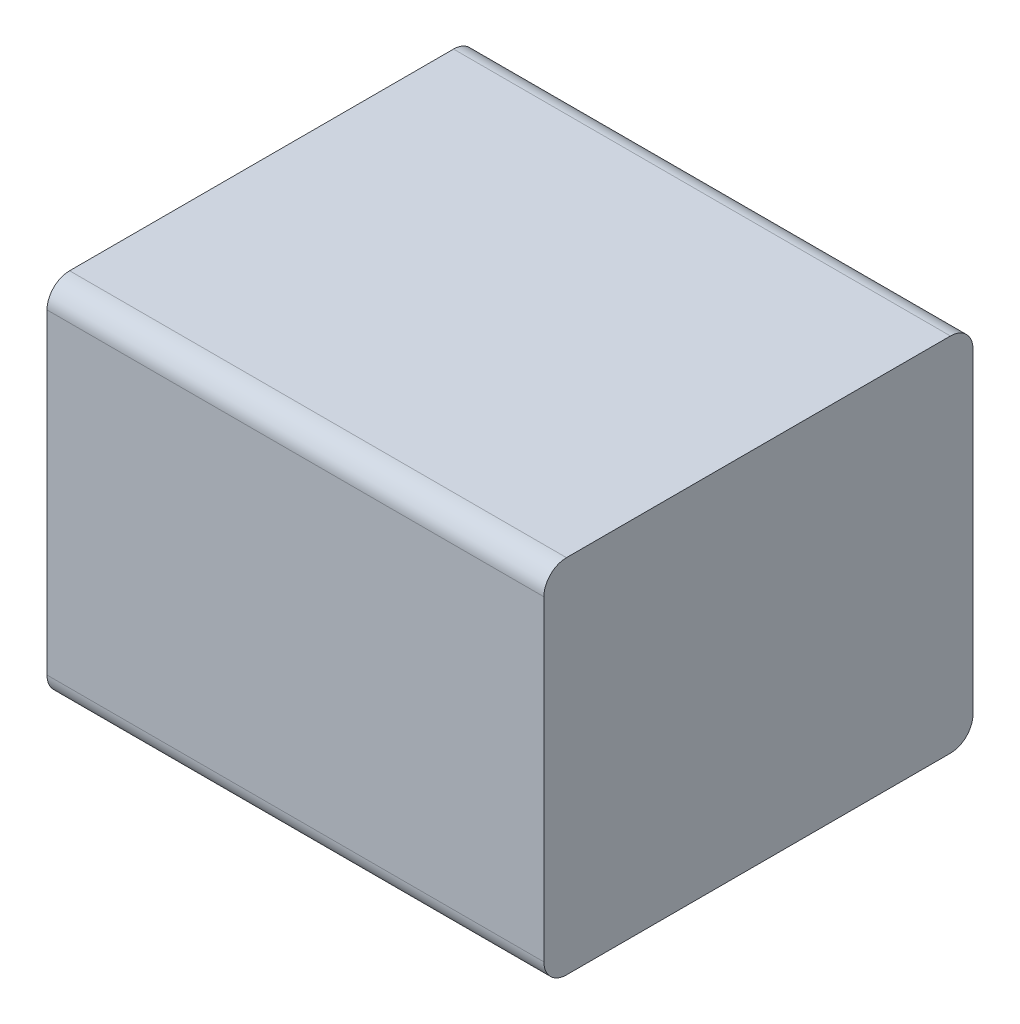
ISO-10303-21;
HEADER;
FILE_DESCRIPTION(('STEP AP214'),'2;1');
FILE_NAME('part.step','',(''),(''),'','','');
FILE_SCHEMA(('AUTOMOTIVE_DESIGN { 1 0 10303 214 1 1 1 1 }'));
ENDSEC;
DATA;
#1=APPLICATION_CONTEXT('core data for automotive mechanical design processes');
#2=APPLICATION_PROTOCOL_DEFINITION('international standard','automotive_design',2000,#1);
#3=PRODUCT_CONTEXT('',#1,'mechanical');
#4=PRODUCT('Part','Part','',(#3));
#5=PRODUCT_RELATED_PRODUCT_CATEGORY('part','',(#4));
#6=PRODUCT_DEFINITION_FORMATION('','',#4);
#7=PRODUCT_DEFINITION_CONTEXT('part definition',#1,'design');
#8=PRODUCT_DEFINITION('design','',#6,#7);
#9=PRODUCT_DEFINITION_SHAPE('','',#8);
#10=(LENGTH_UNIT() NAMED_UNIT(*) SI_UNIT(.MILLI.,.METRE.));
#11=(NAMED_UNIT(*) PLANE_ANGLE_UNIT() SI_UNIT($,.RADIAN.));
#12=(NAMED_UNIT(*) SI_UNIT($,.STERADIAN.) SOLID_ANGLE_UNIT());
#13=UNCERTAINTY_MEASURE_WITH_UNIT(LENGTH_MEASURE(1.E-05),#10,'distance_accuracy_value','');
#14=(GEOMETRIC_REPRESENTATION_CONTEXT(3) GLOBAL_UNCERTAINTY_ASSIGNED_CONTEXT((#13)) GLOBAL_UNIT_ASSIGNED_CONTEXT((#10,
#11,#12)) REPRESENTATION_CONTEXT('',''));
#15=CARTESIAN_POINT('',(0.,0.,0.));
#16=DIRECTION('',(0.,0.,1.));
#17=DIRECTION('',(1.,0.,0.));
#18=AXIS2_PLACEMENT_3D('',#15,#16,#17);
#19=CARTESIAN_POINT('',(-1.1,-0.8,1.9));
#20=DIRECTION('',(0.,1.,0.));
#21=DIRECTION('',(0.,0.,1.));
#22=AXIS2_PLACEMENT_3D('',#19,#20,#21);
#23=PLANE('',#22);
#24=DIRECTION('',(-1.,0.,0.));
#25=VECTOR('',#24,1.);
#26=CARTESIAN_POINT('',(-1.1,-0.8,0.1));
#27=LINE('',#26,#25);
#28=CARTESIAN_POINT('',(1.1,-0.8,0.1));
#29=VERTEX_POINT('',#28);
#30=CARTESIAN_POINT('',(-1.1,-0.8,0.1));
#31=VERTEX_POINT('',#30);
#32=EDGE_CURVE('E103',#29,#31,#27,.T.);
#33=ORIENTED_EDGE('',*,*,#32,.F.);
#34=DIRECTION('',(0.,0.,1.));
#35=VECTOR('',#34,1.);
#36=CARTESIAN_POINT('',(1.1,-0.8,1.9));
#37=LINE('',#36,#35);
#38=CARTESIAN_POINT('',(1.1,-0.8,1.8));
#39=VERTEX_POINT('',#38);
#40=EDGE_CURVE('E110',#39,#29,#37,.F.);
#41=ORIENTED_EDGE('',*,*,#40,.F.);
#42=DIRECTION('',(1.,0.,0.));
#43=VECTOR('',#42,1.);
#44=CARTESIAN_POINT('',(0.,-0.8,1.8));
#45=LINE('',#44,#43);
#46=CARTESIAN_POINT('',(-1.1,-0.8,1.8));
#47=VERTEX_POINT('',#46);
#48=EDGE_CURVE('E89',#47,#39,#45,.T.);
#49=ORIENTED_EDGE('',*,*,#48,.F.);
#50=DIRECTION('',(0.,0.,1.));
#51=VECTOR('',#50,1.);
#52=CARTESIAN_POINT('',(-1.1,-0.8,1.9));
#53=LINE('',#52,#51);
#54=EDGE_CURVE('E84',#31,#47,#53,.T.);
#55=ORIENTED_EDGE('',*,*,#54,.F.);
#56=EDGE_LOOP('',(#33,#41,#49,#55));
#57=FACE_BOUND('',#56,.T.);
#58=ADVANCED_FACE('F17',(#57),#23,.F.);
#59=CARTESIAN_POINT('',(0.,-0.7,1.8));
#60=DIRECTION('',(1.,0.,0.));
#61=DIRECTION('',(0.,0.,-1.));
#62=AXIS2_PLACEMENT_3D('',#59,#60,#61);
#63=CYLINDRICAL_SURFACE('',#62,0.1);
#64=CARTESIAN_POINT('',(1.1,-0.7,1.8));
#65=DIRECTION('',(1.,0.,0.));
#66=DIRECTION('',(0.,0.,-1.));
#67=AXIS2_PLACEMENT_3D('',#64,#65,#66);
#68=CIRCLE('',#67,0.1);
#69=CARTESIAN_POINT('',(1.1,-0.7,1.9));
#70=VERTEX_POINT('',#69);
#71=EDGE_CURVE('E102',#39,#70,#68,.F.);
#72=ORIENTED_EDGE('',*,*,#71,.T.);
#73=DIRECTION('',(1.,0.,0.));
#74=VECTOR('',#73,1.);
#75=CARTESIAN_POINT('',(0.,-0.7,1.9));
#76=LINE('',#75,#74);
#77=CARTESIAN_POINT('',(-1.1,-0.7,1.9));
#78=VERTEX_POINT('',#77);
#79=EDGE_CURVE('E93',#70,#78,#76,.F.);
#80=ORIENTED_EDGE('',*,*,#79,.T.);
#81=CARTESIAN_POINT('',(-1.1,-0.7,1.8));
#82=DIRECTION('',(1.,0.,0.));
#83=DIRECTION('',(0.,0.,-1.));
#84=AXIS2_PLACEMENT_3D('',#81,#82,#83);
#85=CIRCLE('',#84,0.1);
#86=EDGE_CURVE('E20',#78,#47,#85,.T.);
#87=ORIENTED_EDGE('',*,*,#86,.T.);
#88=ORIENTED_EDGE('',*,*,#48,.T.);
#89=EDGE_LOOP('',(#72,#80,#87,#88));
#90=FACE_BOUND('',#89,.T.);
#91=ADVANCED_FACE('F100',(#90),#63,.T.);
#92=CARTESIAN_POINT('',(-1.1,-0.7,0.1));
#93=DIRECTION('',(-1.,0.,0.));
#94=DIRECTION('',(0.,0.,1.));
#95=AXIS2_PLACEMENT_3D('',#92,#93,#94);
#96=CYLINDRICAL_SURFACE('',#95,0.1);
#97=CARTESIAN_POINT('',(1.1,-0.7,0.1));
#98=DIRECTION('',(-1.,0.,0.));
#99=DIRECTION('',(0.,0.,1.));
#100=AXIS2_PLACEMENT_3D('',#97,#98,#99);
#101=CIRCLE('',#100,0.1);
#102=CARTESIAN_POINT('',(1.1,-0.7,0.));
#103=VERTEX_POINT('',#102);
#104=EDGE_CURVE('E106',#103,#29,#101,.T.);
#105=ORIENTED_EDGE('',*,*,#104,.T.);
#106=ORIENTED_EDGE('',*,*,#32,.T.);
#107=CARTESIAN_POINT('',(-1.1,-0.7,0.1));
#108=DIRECTION('',(-1.,0.,0.));
#109=DIRECTION('',(0.,0.,1.));
#110=AXIS2_PLACEMENT_3D('',#107,#108,#109);
#111=CIRCLE('',#110,0.1);
#112=CARTESIAN_POINT('',(-1.1,-0.7,0.));
#113=VERTEX_POINT('',#112);
#114=EDGE_CURVE('E127',#31,#113,#111,.F.);
#115=ORIENTED_EDGE('',*,*,#114,.T.);
#116=DIRECTION('',(1.,0.,0.));
#117=VECTOR('',#116,1.);
#118=CARTESIAN_POINT('',(0.,-0.7,0.));
#119=LINE('',#118,#117);
#120=EDGE_CURVE('E132',#103,#113,#119,.F.);
#121=ORIENTED_EDGE('',*,*,#120,.F.);
#122=EDGE_LOOP('',(#105,#106,#115,#121));
#123=FACE_BOUND('',#122,.T.);
#124=ADVANCED_FACE('F131',(#123),#96,.T.);
#125=CARTESIAN_POINT('',(0.,0.,1.9));
#126=DIRECTION('',(0.,0.,-1.));
#127=DIRECTION('',(0.,1.,0.));
#128=AXIS2_PLACEMENT_3D('',#125,#126,#127);
#129=PLANE('',#128);
#130=DIRECTION('',(-1.,0.,0.));
#131=VECTOR('',#130,1.);
#132=CARTESIAN_POINT('',(0.,0.7,1.9));
#133=LINE('',#132,#131);
#134=CARTESIAN_POINT('',(-1.1,0.7,1.9));
#135=VERTEX_POINT('',#134);
#136=CARTESIAN_POINT('',(1.1,0.7,1.9));
#137=VERTEX_POINT('',#136);
#138=EDGE_CURVE('E96',#135,#137,#133,.F.);
#139=ORIENTED_EDGE('',*,*,#138,.F.);
#140=DIRECTION('',(0.,1.,0.));
#141=VECTOR('',#140,1.);
#142=CARTESIAN_POINT('',(-1.1,0.,1.9));
#143=LINE('',#142,#141);
#144=EDGE_CURVE('E81',#78,#135,#143,.T.);
#145=ORIENTED_EDGE('',*,*,#144,.F.);
#146=ORIENTED_EDGE('',*,*,#79,.F.);
#147=DIRECTION('',(0.,1.,0.));
#148=VECTOR('',#147,1.);
#149=CARTESIAN_POINT('',(1.1,0.,1.9));
#150=LINE('',#149,#148);
#151=EDGE_CURVE('E98',#137,#70,#150,.F.);
#152=ORIENTED_EDGE('',*,*,#151,.F.);
#153=EDGE_LOOP('',(#139,#145,#146,#152));
#154=FACE_BOUND('',#153,.T.);
#155=ADVANCED_FACE('F92',(#154),#129,.F.);
#156=CARTESIAN_POINT('',(0.,0.,0.));
#157=DIRECTION('',(0.,0.,-1.));
#158=DIRECTION('',(0.,1.,0.));
#159=AXIS2_PLACEMENT_3D('',#156,#157,#158);
#160=PLANE('',#159);
#161=DIRECTION('',(0.,1.,0.));
#162=VECTOR('',#161,1.);
#163=CARTESIAN_POINT('',(1.1,0.,0.));
#164=LINE('',#163,#162);
#165=CARTESIAN_POINT('',(1.1,0.7,0.));
#166=VERTEX_POINT('',#165);
#167=EDGE_CURVE('E139',#166,#103,#164,.F.);
#168=ORIENTED_EDGE('',*,*,#167,.T.);
#169=ORIENTED_EDGE('',*,*,#120,.T.);
#170=DIRECTION('',(0.,1.,0.));
#171=VECTOR('',#170,1.);
#172=CARTESIAN_POINT('',(-1.1,-0.8,0.));
#173=LINE('',#172,#171);
#174=CARTESIAN_POINT('',(-1.1,0.7,0.));
#175=VERTEX_POINT('',#174);
#176=EDGE_CURVE('E125',#113,#175,#173,.T.);
#177=ORIENTED_EDGE('',*,*,#176,.T.);
#178=DIRECTION('',(1.,0.,0.));
#179=VECTOR('',#178,1.);
#180=CARTESIAN_POINT('',(-1.1,0.7,0.));
#181=LINE('',#180,#179);
#182=EDGE_CURVE('E122',#166,#175,#181,.F.);
#183=ORIENTED_EDGE('',*,*,#182,.F.);
#184=EDGE_LOOP('',(#168,#169,#177,#183));
#185=FACE_BOUND('',#184,.T.);
#186=ADVANCED_FACE('F137',(#185),#160,.T.);
#187=CARTESIAN_POINT('',(0.,0.7,1.8));
#188=DIRECTION('',(-1.,0.,0.));
#189=DIRECTION('',(0.,0.,1.));
#190=AXIS2_PLACEMENT_3D('',#187,#188,#189);
#191=CYLINDRICAL_SURFACE('',#190,0.1);
#192=CARTESIAN_POINT('',(-1.1,0.7,1.8));
#193=DIRECTION('',(-1.,0.,0.));
#194=DIRECTION('',(0.,0.,1.));
#195=AXIS2_PLACEMENT_3D('',#192,#193,#194);
#196=CIRCLE('',#195,0.1);
#197=CARTESIAN_POINT('',(-1.1,0.8,1.8));
#198=VERTEX_POINT('',#197);
#199=EDGE_CURVE('E123',#198,#135,#196,.F.);
#200=ORIENTED_EDGE('',*,*,#199,.T.);
#201=ORIENTED_EDGE('',*,*,#138,.T.);
#202=CARTESIAN_POINT('',(1.1,0.7,1.8));
#203=DIRECTION('',(-1.,0.,0.));
#204=DIRECTION('',(0.,0.,1.));
#205=AXIS2_PLACEMENT_3D('',#202,#203,#204);
#206=CIRCLE('',#205,0.1);
#207=CARTESIAN_POINT('',(1.1,0.8,1.8));
#208=VERTEX_POINT('',#207);
#209=EDGE_CURVE('E117',#137,#208,#206,.T.);
#210=ORIENTED_EDGE('',*,*,#209,.T.);
#211=DIRECTION('',(1.,0.,0.));
#212=VECTOR('',#211,1.);
#213=CARTESIAN_POINT('',(-1.1,0.8,1.8));
#214=LINE('',#213,#212);
#215=EDGE_CURVE('E116',#208,#198,#214,.F.);
#216=ORIENTED_EDGE('',*,*,#215,.T.);
#217=EDGE_LOOP('',(#200,#201,#210,#216));
#218=FACE_BOUND('',#217,.T.);
#219=ADVANCED_FACE('F153',(#218),#191,.T.);
#220=CARTESIAN_POINT('',(-1.1,-0.8,1.9));
#221=DIRECTION('',(1.,0.,0.));
#222=DIRECTION('',(0.,0.,-1.));
#223=AXIS2_PLACEMENT_3D('',#220,#221,#222);
#224=PLANE('',#223);
#225=CARTESIAN_POINT('',(-1.1,0.7,0.1));
#226=DIRECTION('',(1.,0.,0.));
#227=DIRECTION('',(0.,0.,-1.));
#228=AXIS2_PLACEMENT_3D('',#225,#226,#227);
#229=CIRCLE('',#228,0.1);
#230=CARTESIAN_POINT('',(-1.1,0.8,0.1));
#231=VERTEX_POINT('',#230);
#232=EDGE_CURVE('E120',#175,#231,#229,.T.);
#233=ORIENTED_EDGE('',*,*,#232,.F.);
#234=ORIENTED_EDGE('',*,*,#176,.F.);
#235=ORIENTED_EDGE('',*,*,#114,.F.);
#236=ORIENTED_EDGE('',*,*,#54,.T.);
#237=ORIENTED_EDGE('',*,*,#86,.F.);
#238=ORIENTED_EDGE('',*,*,#144,.T.);
#239=ORIENTED_EDGE('',*,*,#199,.F.);
#240=DIRECTION('',(0.,0.,-1.));
#241=VECTOR('',#240,1.);
#242=CARTESIAN_POINT('',(-1.1,0.8,1.9));
#243=LINE('',#242,#241);
#244=EDGE_CURVE('E146',#198,#231,#243,.T.);
#245=ORIENTED_EDGE('',*,*,#244,.T.);
#246=EDGE_LOOP('',(#233,#234,#235,#236,#237,#238,#239,#245));
#247=FACE_BOUND('',#246,.T.);
#248=ADVANCED_FACE('F80',(#247),#224,.F.);
#249=CARTESIAN_POINT('',(-1.1,0.7,0.1));
#250=DIRECTION('',(1.,0.,0.));
#251=DIRECTION('',(0.,0.,-1.));
#252=AXIS2_PLACEMENT_3D('',#249,#250,#251);
#253=CYLINDRICAL_SURFACE('',#252,0.1);
#254=ORIENTED_EDGE('',*,*,#232,.T.);
#255=DIRECTION('',(1.,0.,0.));
#256=VECTOR('',#255,1.);
#257=CARTESIAN_POINT('',(-1.1,0.8,0.1));
#258=LINE('',#257,#256);
#259=CARTESIAN_POINT('',(1.1,0.8,0.1));
#260=VERTEX_POINT('',#259);
#261=EDGE_CURVE('E26',#231,#260,#258,.T.);
#262=ORIENTED_EDGE('',*,*,#261,.T.);
#263=CARTESIAN_POINT('',(1.1,0.7,0.1));
#264=DIRECTION('',(1.,0.,0.));
#265=DIRECTION('',(0.,0.,-1.));
#266=AXIS2_PLACEMENT_3D('',#263,#264,#265);
#267=CIRCLE('',#266,0.1);
#268=EDGE_CURVE('E34',#260,#166,#267,.F.);
#269=ORIENTED_EDGE('',*,*,#268,.T.);
#270=ORIENTED_EDGE('',*,*,#182,.T.);
#271=EDGE_LOOP('',(#254,#262,#269,#270));
#272=FACE_BOUND('',#271,.T.);
#273=ADVANCED_FACE('F162',(#272),#253,.T.);
#274=CARTESIAN_POINT('',(1.1,-0.8,1.9));
#275=DIRECTION('',(-1.,0.,0.));
#276=DIRECTION('',(0.,0.,1.));
#277=AXIS2_PLACEMENT_3D('',#274,#275,#276);
#278=PLANE('',#277);
#279=ORIENTED_EDGE('',*,*,#268,.F.);
#280=DIRECTION('',(0.,0.,-1.));
#281=VECTOR('',#280,1.);
#282=CARTESIAN_POINT('',(1.1,0.8,1.9));
#283=LINE('',#282,#281);
#284=EDGE_CURVE('E11',#260,#208,#283,.F.);
#285=ORIENTED_EDGE('',*,*,#284,.T.);
#286=ORIENTED_EDGE('',*,*,#209,.F.);
#287=ORIENTED_EDGE('',*,*,#151,.T.);
#288=ORIENTED_EDGE('',*,*,#71,.F.);
#289=ORIENTED_EDGE('',*,*,#40,.T.);
#290=ORIENTED_EDGE('',*,*,#104,.F.);
#291=ORIENTED_EDGE('',*,*,#167,.F.);
#292=EDGE_LOOP('',(#279,#285,#286,#287,#288,#289,#290,#291));
#293=FACE_BOUND('',#292,.T.);
#294=ADVANCED_FACE('F151',(#293),#278,.F.);
#295=CARTESIAN_POINT('',(-1.1,0.8,1.9));
#296=DIRECTION('',(0.,-1.,0.));
#297=DIRECTION('',(0.,0.,-1.));
#298=AXIS2_PLACEMENT_3D('',#295,#296,#297);
#299=PLANE('',#298);
#300=ORIENTED_EDGE('',*,*,#261,.F.);
#301=ORIENTED_EDGE('',*,*,#244,.F.);
#302=ORIENTED_EDGE('',*,*,#215,.F.);
#303=ORIENTED_EDGE('',*,*,#284,.F.);
#304=EDGE_LOOP('',(#300,#301,#302,#303));
#305=FACE_BOUND('',#304,.T.);
#306=ADVANCED_FACE('F158',(#305),#299,.F.);
#307=CLOSED_SHELL('',(#58,#91,#124,#155,#186,#219,#248,#273,#294,#306));
#308=MANIFOLD_SOLID_BREP('B1',#307);
#309=ADVANCED_BREP_SHAPE_REPRESENTATION('',(#18,#308),#14);
#310=SHAPE_DEFINITION_REPRESENTATION(#9,#309);
ENDSEC;
END-ISO-10303-21;
